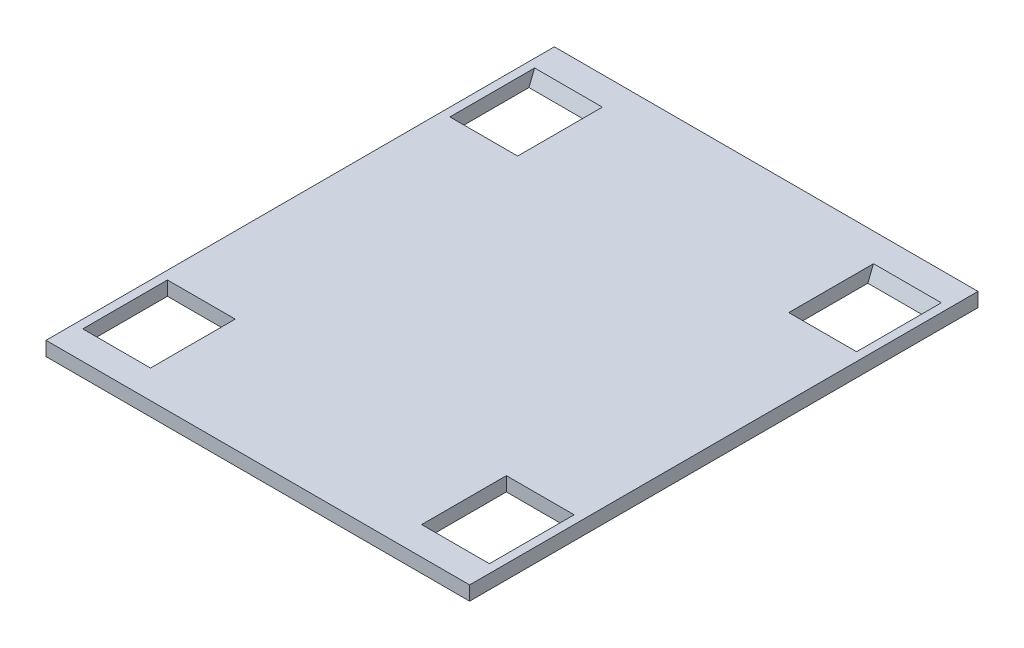
ISO-10303-21;
HEADER;
FILE_DESCRIPTION(('STEP AP214'),'2;1');
FILE_NAME('part.step','',(''),(''),'','','');
FILE_SCHEMA(('AUTOMOTIVE_DESIGN { 1 0 10303 214 1 1 1 1 }'));
ENDSEC;
DATA;
#1=APPLICATION_CONTEXT('core data for automotive mechanical design processes');
#2=APPLICATION_PROTOCOL_DEFINITION('international standard','automotive_design',2000,#1);
#3=PRODUCT_CONTEXT('',#1,'mechanical');
#4=PRODUCT('Part','Part','',(#3));
#5=PRODUCT_RELATED_PRODUCT_CATEGORY('part','',(#4));
#6=PRODUCT_DEFINITION_FORMATION('','',#4);
#7=PRODUCT_DEFINITION_CONTEXT('part definition',#1,'design');
#8=PRODUCT_DEFINITION('design','',#6,#7);
#9=PRODUCT_DEFINITION_SHAPE('','',#8);
#10=(LENGTH_UNIT() NAMED_UNIT(*) SI_UNIT(.MILLI.,.METRE.));
#11=(NAMED_UNIT(*) PLANE_ANGLE_UNIT() SI_UNIT($,.RADIAN.));
#12=(NAMED_UNIT(*) SI_UNIT($,.STERADIAN.) SOLID_ANGLE_UNIT());
#13=UNCERTAINTY_MEASURE_WITH_UNIT(LENGTH_MEASURE(1.E-05),#10,'distance_accuracy_value','');
#14=(GEOMETRIC_REPRESENTATION_CONTEXT(3) GLOBAL_UNCERTAINTY_ASSIGNED_CONTEXT((#13)) GLOBAL_UNIT_ASSIGNED_CONTEXT((#10,
#11,#12)) REPRESENTATION_CONTEXT('',''));
#15=CARTESIAN_POINT('',(0.,0.,0.));
#16=DIRECTION('',(0.,0.,1.));
#17=DIRECTION('',(1.,0.,0.));
#18=AXIS2_PLACEMENT_3D('',#15,#16,#17);
#19=CARTESIAN_POINT('',(-91.4400000000001,-0.00100000000000013,101.6));
#20=DIRECTION('',(-1.,0.,0.));
#21=DIRECTION('',(0.,0.,1.));
#22=AXIS2_PLACEMENT_3D('',#19,#20,#21);
#23=PLANE('',#22);
#24=DIRECTION('',(0.,0.928476690885259,0.371390676354104));
#25=VECTOR('',#24,1.);
#26=CARTESIAN_POINT('',(-91.4400000000002,6.35,101.6));
#27=LINE('',#26,#25);
#28=CARTESIAN_POINT('',(-91.4400000000001,0.,99.06));
#29=VERTEX_POINT('',#28);
#30=CARTESIAN_POINT('',(-91.4400000000001,6.35,101.6));
#31=VERTEX_POINT('',#30);
#32=EDGE_CURVE('E55',#29,#31,#27,.T.);
#33=ORIENTED_EDGE('',*,*,#32,.F.);
#34=DIRECTION('',(0.,0.,-1.));
#35=VECTOR('',#34,1.);
#36=CARTESIAN_POINT('',(-91.4400000000001,0.,101.6));
#37=LINE('',#36,#35);
#38=CARTESIAN_POINT('',(-91.4400000000001,0.,63.5));
#39=VERTEX_POINT('',#38);
#40=EDGE_CURVE('E240',#29,#39,#37,.T.);
#41=ORIENTED_EDGE('',*,*,#40,.T.);
#42=DIRECTION('',(0.,1.,0.));
#43=VECTOR('',#42,1.);
#44=CARTESIAN_POINT('',(-91.4400000000001,-0.00100000000000013,63.5));
#45=LINE('',#44,#43);
#46=CARTESIAN_POINT('',(-91.4400000000001,6.35,63.5));
#47=VERTEX_POINT('',#46);
#48=EDGE_CURVE('E191',#39,#47,#45,.T.);
#49=ORIENTED_EDGE('',*,*,#48,.T.);
#50=DIRECTION('',(0.,0.,1.));
#51=VECTOR('',#50,1.);
#52=CARTESIAN_POINT('',(-91.4400000000001,6.35,101.6));
#53=LINE('',#52,#51);
#54=EDGE_CURVE('E243',#47,#31,#53,.T.);
#55=ORIENTED_EDGE('',*,*,#54,.T.);
#56=EDGE_LOOP('',(#33,#41,#49,#55));
#57=FACE_BOUND('',#56,.T.);
#58=ADVANCED_FACE('F39',(#57),#23,.F.);
#59=CARTESIAN_POINT('',(-60.9600000000001,-0.00100000000000013,101.6));
#60=DIRECTION('',(1.,0.,0.));
#61=DIRECTION('',(0.,0.,-1.));
#62=AXIS2_PLACEMENT_3D('',#59,#60,#61);
#63=PLANE('',#62);
#64=DIRECTION('',(0.,0.928476690885259,0.371390676354104));
#65=VECTOR('',#64,1.);
#66=CARTESIAN_POINT('',(-60.9600000000001,6.35000000000001,101.6));
#67=LINE('',#66,#65);
#68=CARTESIAN_POINT('',(-60.9600000000001,0.,99.06));
#69=VERTEX_POINT('',#68);
#70=CARTESIAN_POINT('',(-60.9600000000001,6.35,101.6));
#71=VERTEX_POINT('',#70);
#72=EDGE_CURVE('E614',#69,#71,#67,.T.);
#73=ORIENTED_EDGE('',*,*,#72,.T.);
#74=DIRECTION('',(0.,0.,-1.));
#75=VECTOR('',#74,1.);
#76=CARTESIAN_POINT('',(-60.9600000000001,6.35,101.6));
#77=LINE('',#76,#75);
#78=CARTESIAN_POINT('',(-60.9600000000001,6.35,63.5));
#79=VERTEX_POINT('',#78);
#80=EDGE_CURVE('E250',#71,#79,#77,.T.);
#81=ORIENTED_EDGE('',*,*,#80,.T.);
#82=DIRECTION('',(0.,1.,0.));
#83=VECTOR('',#82,1.);
#84=CARTESIAN_POINT('',(-60.9600000000001,-0.00100000000000013,63.5));
#85=LINE('',#84,#83);
#86=CARTESIAN_POINT('',(-60.9600000000001,0.,63.5));
#87=VERTEX_POINT('',#86);
#88=EDGE_CURVE('E258',#87,#79,#85,.T.);
#89=ORIENTED_EDGE('',*,*,#88,.F.);
#90=DIRECTION('',(0.,0.,1.));
#91=VECTOR('',#90,1.);
#92=CARTESIAN_POINT('',(-60.9600000000001,0.,101.6));
#93=LINE('',#92,#91);
#94=EDGE_CURVE('E63',#87,#69,#93,.T.);
#95=ORIENTED_EDGE('',*,*,#94,.T.);
#96=EDGE_LOOP('',(#73,#81,#89,#95));
#97=FACE_BOUND('',#96,.T.);
#98=ADVANCED_FACE('F408',(#97),#63,.F.);
#99=CARTESIAN_POINT('',(91.4400000000001,-0.00100000000000013,-101.6));
#100=DIRECTION('',(1.,0.,0.));
#101=DIRECTION('',(0.,0.,-1.));
#102=AXIS2_PLACEMENT_3D('',#99,#100,#101);
#103=PLANE('',#102);
#104=DIRECTION('',(0.,0.928476690885259,-0.371390676354104));
#105=VECTOR('',#104,1.);
#106=CARTESIAN_POINT('',(91.4400000000002,6.35,-101.6));
#107=LINE('',#106,#105);
#108=CARTESIAN_POINT('',(91.4400000000001,0.,-99.06));
#109=VERTEX_POINT('',#108);
#110=CARTESIAN_POINT('',(91.4400000000001,6.35,-101.6));
#111=VERTEX_POINT('',#110);
#112=EDGE_CURVE('E222',#109,#111,#107,.T.);
#113=ORIENTED_EDGE('',*,*,#112,.F.);
#114=DIRECTION('',(0.,0.,1.));
#115=VECTOR('',#114,1.);
#116=CARTESIAN_POINT('',(91.4400000000001,0.,-101.6));
#117=LINE('',#116,#115);
#118=CARTESIAN_POINT('',(91.4400000000001,0.,-63.5));
#119=VERTEX_POINT('',#118);
#120=EDGE_CURVE('E299',#109,#119,#117,.T.);
#121=ORIENTED_EDGE('',*,*,#120,.T.);
#122=DIRECTION('',(0.,1.,0.));
#123=VECTOR('',#122,1.);
#124=CARTESIAN_POINT('',(91.4400000000001,-0.00100000000000013,-63.5));
#125=LINE('',#124,#123);
#126=CARTESIAN_POINT('',(91.4400000000001,6.35,-63.5));
#127=VERTEX_POINT('',#126);
#128=EDGE_CURVE('E267',#119,#127,#125,.T.);
#129=ORIENTED_EDGE('',*,*,#128,.T.);
#130=DIRECTION('',(0.,0.,-1.));
#131=VECTOR('',#130,1.);
#132=CARTESIAN_POINT('',(91.4400000000001,6.35,-101.6));
#133=LINE('',#132,#131);
#134=EDGE_CURVE('E302',#127,#111,#133,.T.);
#135=ORIENTED_EDGE('',*,*,#134,.T.);
#136=EDGE_LOOP('',(#113,#121,#129,#135));
#137=FACE_BOUND('',#136,.T.);
#138=ADVANCED_FACE('F413',(#137),#103,.F.);
#139=CARTESIAN_POINT('',(60.9600000000001,-0.00100000000000013,-101.6));
#140=DIRECTION('',(-1.,0.,0.));
#141=DIRECTION('',(0.,0.,1.));
#142=AXIS2_PLACEMENT_3D('',#139,#140,#141);
#143=PLANE('',#142);
#144=DIRECTION('',(0.,0.928476690885259,-0.371390676354104));
#145=VECTOR('',#144,1.);
#146=CARTESIAN_POINT('',(60.9600000000001,6.35000000000001,-101.6));
#147=LINE('',#146,#145);
#148=CARTESIAN_POINT('',(60.9600000000001,0.,-99.06));
#149=VERTEX_POINT('',#148);
#150=CARTESIAN_POINT('',(60.9600000000001,6.35,-101.6));
#151=VERTEX_POINT('',#150);
#152=EDGE_CURVE('E218',#149,#151,#147,.T.);
#153=ORIENTED_EDGE('',*,*,#152,.T.);
#154=DIRECTION('',(0.,0.,1.));
#155=VECTOR('',#154,1.);
#156=CARTESIAN_POINT('',(60.9600000000001,6.35,-101.6));
#157=LINE('',#156,#155);
#158=CARTESIAN_POINT('',(60.9600000000001,6.35,-63.5));
#159=VERTEX_POINT('',#158);
#160=EDGE_CURVE('E309',#151,#159,#157,.T.);
#161=ORIENTED_EDGE('',*,*,#160,.T.);
#162=DIRECTION('',(0.,1.,0.));
#163=VECTOR('',#162,1.);
#164=CARTESIAN_POINT('',(60.9600000000001,-0.00100000000000013,-63.5));
#165=LINE('',#164,#163);
#166=CARTESIAN_POINT('',(60.9600000000001,0.,-63.5));
#167=VERTEX_POINT('',#166);
#168=EDGE_CURVE('E317',#167,#159,#165,.T.);
#169=ORIENTED_EDGE('',*,*,#168,.F.);
#170=DIRECTION('',(0.,0.,-1.));
#171=VECTOR('',#170,1.);
#172=CARTESIAN_POINT('',(60.9600000000001,0.,-101.6));
#173=LINE('',#172,#171);
#174=EDGE_CURVE('E226',#167,#149,#173,.T.);
#175=ORIENTED_EDGE('',*,*,#174,.T.);
#176=EDGE_LOOP('',(#153,#161,#169,#175));
#177=FACE_BOUND('',#176,.T.);
#178=ADVANCED_FACE('F406',(#177),#143,.F.);
#179=CARTESIAN_POINT('',(95.25,6.35,-114.3));
#180=DIRECTION('',(-1.,0.,0.));
#181=DIRECTION('',(0.,0.,1.));
#182=AXIS2_PLACEMENT_3D('',#179,#180,#181);
#183=PLANE('',#182);
#184=DIRECTION('',(0.,0.,-1.));
#185=VECTOR('',#184,1.);
#186=CARTESIAN_POINT('',(95.25,0.,-114.3));
#187=LINE('',#186,#185);
#188=CARTESIAN_POINT('',(95.25,0.,114.3));
#189=VERTEX_POINT('',#188);
#190=CARTESIAN_POINT('',(95.25,0.,-114.3));
#191=VERTEX_POINT('',#190);
#192=EDGE_CURVE('E345',#189,#191,#187,.T.);
#193=ORIENTED_EDGE('',*,*,#192,.T.);
#194=DIRECTION('',(0.,-1.,0.));
#195=VECTOR('',#194,1.);
#196=CARTESIAN_POINT('',(95.25,6.35,-114.3));
#197=LINE('',#196,#195);
#198=CARTESIAN_POINT('',(95.25,6.35,-114.3));
#199=VERTEX_POINT('',#198);
#200=EDGE_CURVE('E11',#199,#191,#197,.T.);
#201=ORIENTED_EDGE('',*,*,#200,.F.);
#202=DIRECTION('',(0.,0.,-1.));
#203=VECTOR('',#202,1.);
#204=CARTESIAN_POINT('',(95.25,6.35,-114.3));
#205=LINE('',#204,#203);
#206=CARTESIAN_POINT('',(95.25,6.35,114.3));
#207=VERTEX_POINT('',#206);
#208=EDGE_CURVE('E346',#207,#199,#205,.T.);
#209=ORIENTED_EDGE('',*,*,#208,.F.);
#210=DIRECTION('',(0.,-1.,0.));
#211=VECTOR('',#210,1.);
#212=CARTESIAN_POINT('',(95.25,6.35,114.3));
#213=LINE('',#212,#211);
#214=EDGE_CURVE('E360',#207,#189,#213,.T.);
#215=ORIENTED_EDGE('',*,*,#214,.T.);
#216=EDGE_LOOP('',(#193,#201,#209,#215));
#217=FACE_BOUND('',#216,.T.);
#218=ADVANCED_FACE('F41',(#217),#183,.F.);
#219=CARTESIAN_POINT('',(-95.25,6.35,-114.3));
#220=DIRECTION('',(0.,0.,1.));
#221=DIRECTION('',(1.,0.,0.));
#222=AXIS2_PLACEMENT_3D('',#219,#220,#221);
#223=PLANE('',#222);
#224=DIRECTION('',(-1.,0.,0.));
#225=VECTOR('',#224,1.);
#226=CARTESIAN_POINT('',(-95.25,0.,-114.3));
#227=LINE('',#226,#225);
#228=CARTESIAN_POINT('',(-95.25,0.,-114.3));
#229=VERTEX_POINT('',#228);
#230=EDGE_CURVE('E364',#191,#229,#227,.T.);
#231=ORIENTED_EDGE('',*,*,#230,.T.);
#232=DIRECTION('',(0.,-1.,0.));
#233=VECTOR('',#232,1.);
#234=CARTESIAN_POINT('',(-95.25,6.35,-114.3));
#235=LINE('',#234,#233);
#236=CARTESIAN_POINT('',(-95.25,6.35,-114.3));
#237=VERTEX_POINT('',#236);
#238=EDGE_CURVE('E48',#237,#229,#235,.T.);
#239=ORIENTED_EDGE('',*,*,#238,.F.);
#240=DIRECTION('',(-1.,0.,0.));
#241=VECTOR('',#240,1.);
#242=CARTESIAN_POINT('',(-95.25,6.35,-114.3));
#243=LINE('',#242,#241);
#244=EDGE_CURVE('E350',#199,#237,#243,.T.);
#245=ORIENTED_EDGE('',*,*,#244,.F.);
#246=ORIENTED_EDGE('',*,*,#200,.T.);
#247=EDGE_LOOP('',(#231,#239,#245,#246));
#248=FACE_BOUND('',#247,.T.);
#249=ADVANCED_FACE('F399',(#248),#223,.F.);
#250=CARTESIAN_POINT('',(-95.25,6.35,-114.3));
#251=DIRECTION('',(1.,0.,0.));
#252=DIRECTION('',(0.,0.,-1.));
#253=AXIS2_PLACEMENT_3D('',#250,#251,#252);
#254=PLANE('',#253);
#255=DIRECTION('',(0.,0.,1.));
#256=VECTOR('',#255,1.);
#257=CARTESIAN_POINT('',(-95.25,0.,-114.3));
#258=LINE('',#257,#256);
#259=CARTESIAN_POINT('',(-95.25,0.,114.3));
#260=VERTEX_POINT('',#259);
#261=EDGE_CURVE('E367',#229,#260,#258,.T.);
#262=ORIENTED_EDGE('',*,*,#261,.T.);
#263=DIRECTION('',(0.,-1.,0.));
#264=VECTOR('',#263,1.);
#265=CARTESIAN_POINT('',(-95.25,6.35,114.3));
#266=LINE('',#265,#264);
#267=CARTESIAN_POINT('',(-95.25,6.35,114.3));
#268=VERTEX_POINT('',#267);
#269=EDGE_CURVE('E375',#268,#260,#266,.T.);
#270=ORIENTED_EDGE('',*,*,#269,.F.);
#271=DIRECTION('',(0.,0.,1.));
#272=VECTOR('',#271,1.);
#273=CARTESIAN_POINT('',(-95.25,6.35,-114.3));
#274=LINE('',#273,#272);
#275=EDGE_CURVE('E354',#237,#268,#274,.T.);
#276=ORIENTED_EDGE('',*,*,#275,.F.);
#277=ORIENTED_EDGE('',*,*,#238,.T.);
#278=EDGE_LOOP('',(#262,#270,#276,#277));
#279=FACE_BOUND('',#278,.T.);
#280=ADVANCED_FACE('F384',(#279),#254,.F.);
#281=CARTESIAN_POINT('',(-95.25,6.35,114.3));
#282=DIRECTION('',(0.,0.,-1.));
#283=DIRECTION('',(-1.,0.,0.));
#284=AXIS2_PLACEMENT_3D('',#281,#282,#283);
#285=PLANE('',#284);
#286=DIRECTION('',(1.,0.,0.));
#287=VECTOR('',#286,1.);
#288=CARTESIAN_POINT('',(-95.25,0.,114.3));
#289=LINE('',#288,#287);
#290=EDGE_CURVE('E351',#260,#189,#289,.T.);
#291=ORIENTED_EDGE('',*,*,#290,.T.);
#292=ORIENTED_EDGE('',*,*,#214,.F.);
#293=DIRECTION('',(1.,0.,0.));
#294=VECTOR('',#293,1.);
#295=CARTESIAN_POINT('',(-95.25,6.35,114.3));
#296=LINE('',#295,#294);
#297=EDGE_CURVE('E357',#268,#207,#296,.T.);
#298=ORIENTED_EDGE('',*,*,#297,.F.);
#299=ORIENTED_EDGE('',*,*,#269,.T.);
#300=EDGE_LOOP('',(#291,#292,#298,#299));
#301=FACE_BOUND('',#300,.T.);
#302=ADVANCED_FACE('F392',(#301),#285,.F.);
#303=CARTESIAN_POINT('',(0.,6.35,0.));
#304=DIRECTION('',(0.,1.,0.));
#305=DIRECTION('',(0.,0.,1.));
#306=AXIS2_PLACEMENT_3D('',#303,#304,#305);
#307=PLANE('',#306);
#308=ORIENTED_EDGE('',*,*,#134,.F.);
#309=DIRECTION('',(1.,0.,0.));
#310=VECTOR('',#309,1.);
#311=CARTESIAN_POINT('',(91.4400000000001,6.35,-63.5));
#312=LINE('',#311,#310);
#313=EDGE_CURVE('E313',#159,#127,#312,.T.);
#314=ORIENTED_EDGE('',*,*,#313,.F.);
#315=ORIENTED_EDGE('',*,*,#160,.F.);
#316=DIRECTION('',(-1.,0.,0.));
#317=VECTOR('',#316,1.);
#318=CARTESIAN_POINT('',(91.4400000000001,6.35,-101.6));
#319=LINE('',#318,#317);
#320=EDGE_CURVE('E305',#111,#151,#319,.T.);
#321=ORIENTED_EDGE('',*,*,#320,.F.);
#322=EDGE_LOOP('',(#308,#314,#315,#321));
#323=FACE_BOUND('',#322,.T.);
#324=DIRECTION('',(1.,0.,0.));
#325=VECTOR('',#324,1.);
#326=CARTESIAN_POINT('',(91.4400000000001,6.35,101.6));
#327=LINE('',#326,#325);
#328=CARTESIAN_POINT('',(60.9600000000001,6.35,101.6));
#329=VERTEX_POINT('',#328);
#330=CARTESIAN_POINT('',(91.4400000000001,6.35,101.6));
#331=VERTEX_POINT('',#330);
#332=EDGE_CURVE('E270',#329,#331,#327,.T.);
#333=ORIENTED_EDGE('',*,*,#332,.F.);
#334=DIRECTION('',(0.,0.,1.));
#335=VECTOR('',#334,1.);
#336=CARTESIAN_POINT('',(60.9600000000001,6.35,101.6));
#337=LINE('',#336,#335);
#338=CARTESIAN_POINT('',(60.9600000000001,6.35,63.5));
#339=VERTEX_POINT('',#338);
#340=EDGE_CURVE('E282',#339,#329,#337,.T.);
#341=ORIENTED_EDGE('',*,*,#340,.F.);
#342=DIRECTION('',(-1.,0.,0.));
#343=VECTOR('',#342,1.);
#344=CARTESIAN_POINT('',(91.4400000000001,6.35,63.5));
#345=LINE('',#344,#343);
#346=CARTESIAN_POINT('',(91.4400000000001,6.35,63.5));
#347=VERTEX_POINT('',#346);
#348=EDGE_CURVE('E278',#347,#339,#345,.T.);
#349=ORIENTED_EDGE('',*,*,#348,.F.);
#350=DIRECTION('',(0.,0.,-1.));
#351=VECTOR('',#350,1.);
#352=CARTESIAN_POINT('',(91.4400000000001,6.35,101.6));
#353=LINE('',#352,#351);
#354=EDGE_CURVE('E274',#331,#347,#353,.T.);
#355=ORIENTED_EDGE('',*,*,#354,.F.);
#356=EDGE_LOOP('',(#333,#341,#349,#355));
#357=FACE_BOUND('',#356,.T.);
#358=ORIENTED_EDGE('',*,*,#54,.F.);
#359=DIRECTION('',(-1.,0.,0.));
#360=VECTOR('',#359,1.);
#361=CARTESIAN_POINT('',(-91.4400000000001,6.35,63.5));
#362=LINE('',#361,#360);
#363=EDGE_CURVE('E254',#79,#47,#362,.T.);
#364=ORIENTED_EDGE('',*,*,#363,.F.);
#365=ORIENTED_EDGE('',*,*,#80,.F.);
#366=DIRECTION('',(1.,0.,0.));
#367=VECTOR('',#366,1.);
#368=CARTESIAN_POINT('',(-91.4400000000001,6.35,101.6));
#369=LINE('',#368,#367);
#370=EDGE_CURVE('E246',#31,#71,#369,.T.);
#371=ORIENTED_EDGE('',*,*,#370,.F.);
#372=EDGE_LOOP('',(#358,#364,#365,#371));
#373=FACE_BOUND('',#372,.T.);
#374=DIRECTION('',(0.,0.,1.));
#375=VECTOR('',#374,1.);
#376=CARTESIAN_POINT('',(-91.4400000000001,6.35,-101.6));
#377=LINE('',#376,#375);
#378=CARTESIAN_POINT('',(-91.4400000000001,6.35,-101.6));
#379=VERTEX_POINT('',#378);
#380=CARTESIAN_POINT('',(-91.4400000000001,6.35,-63.5));
#381=VERTEX_POINT('',#380);
#382=EDGE_CURVE('E324',#379,#381,#377,.T.);
#383=ORIENTED_EDGE('',*,*,#382,.F.);
#384=DIRECTION('',(-1.,0.,0.));
#385=VECTOR('',#384,1.);
#386=CARTESIAN_POINT('',(-91.4400000000001,6.35,-101.6));
#387=LINE('',#386,#385);
#388=CARTESIAN_POINT('',(-60.9600000000001,6.35,-101.6));
#389=VERTEX_POINT('',#388);
#390=EDGE_CURVE('E333',#389,#379,#387,.T.);
#391=ORIENTED_EDGE('',*,*,#390,.F.);
#392=DIRECTION('',(0.,0.,-1.));
#393=VECTOR('',#392,1.);
#394=CARTESIAN_POINT('',(-60.9600000000001,6.35,-101.6));
#395=LINE('',#394,#393);
#396=CARTESIAN_POINT('',(-60.9600000000001,6.35,-63.5));
#397=VERTEX_POINT('',#396);
#398=EDGE_CURVE('E197',#397,#389,#395,.T.);
#399=ORIENTED_EDGE('',*,*,#398,.F.);
#400=DIRECTION('',(1.,0.,0.));
#401=VECTOR('',#400,1.);
#402=CARTESIAN_POINT('',(-91.4400000000001,6.35,-63.5));
#403=LINE('',#402,#401);
#404=EDGE_CURVE('E327',#381,#397,#403,.T.);
#405=ORIENTED_EDGE('',*,*,#404,.F.);
#406=EDGE_LOOP('',(#383,#391,#399,#405));
#407=FACE_BOUND('',#406,.T.);
#408=ORIENTED_EDGE('',*,*,#208,.T.);
#409=ORIENTED_EDGE('',*,*,#244,.T.);
#410=ORIENTED_EDGE('',*,*,#275,.T.);
#411=ORIENTED_EDGE('',*,*,#297,.T.);
#412=EDGE_LOOP('',(#408,#409,#410,#411));
#413=FACE_BOUND('',#412,.T.);
#414=ADVANCED_FACE('F398',(#323,#357,#373,#407,#413),#307,.T.);
#415=CARTESIAN_POINT('',(0.,0.,0.));
#416=DIRECTION('',(0.,1.,0.));
#417=DIRECTION('',(0.,0.,1.));
#418=AXIS2_PLACEMENT_3D('',#415,#416,#417);
#419=PLANE('',#418);
#420=ORIENTED_EDGE('',*,*,#40,.F.);
#421=DIRECTION('',(-1.,0.,0.));
#422=VECTOR('',#421,1.);
#423=CARTESIAN_POINT('',(95.2519999999999,0.,99.0600000000001));
#424=LINE('',#423,#422);
#425=EDGE_CURVE('E616',#69,#29,#424,.T.);
#426=ORIENTED_EDGE('',*,*,#425,.F.);
#427=ORIENTED_EDGE('',*,*,#94,.F.);
#428=DIRECTION('',(1.,0.,0.));
#429=VECTOR('',#428,1.);
#430=CARTESIAN_POINT('',(-91.4400000000001,0.,63.5));
#431=LINE('',#430,#429);
#432=EDGE_CURVE('E235',#39,#87,#431,.T.);
#433=ORIENTED_EDGE('',*,*,#432,.F.);
#434=EDGE_LOOP('',(#420,#426,#427,#433));
#435=FACE_BOUND('',#434,.T.);
#436=DIRECTION('',(-1.,0.,0.));
#437=VECTOR('',#436,1.);
#438=CARTESIAN_POINT('',(95.252,0.,-99.0600000000001));
#439=LINE('',#438,#437);
#440=CARTESIAN_POINT('',(-60.96,0.,-99.06));
#441=VERTEX_POINT('',#440);
#442=CARTESIAN_POINT('',(-91.4400000000001,0.,-99.06));
#443=VERTEX_POINT('',#442);
#444=EDGE_CURVE('E183',#441,#443,#439,.T.);
#445=ORIENTED_EDGE('',*,*,#444,.T.);
#446=DIRECTION('',(0.,0.,-1.));
#447=VECTOR('',#446,1.);
#448=CARTESIAN_POINT('',(-91.4400000000001,0.,-101.6));
#449=LINE('',#448,#447);
#450=CARTESIAN_POINT('',(-91.4400000000001,0.,-63.5));
#451=VERTEX_POINT('',#450);
#452=EDGE_CURVE('E190',#451,#443,#449,.T.);
#453=ORIENTED_EDGE('',*,*,#452,.F.);
#454=DIRECTION('',(-1.,0.,0.));
#455=VECTOR('',#454,1.);
#456=CARTESIAN_POINT('',(-91.4400000000001,0.,-63.5));
#457=LINE('',#456,#455);
#458=CARTESIAN_POINT('',(-60.9600000000001,0.,-63.5));
#459=VERTEX_POINT('',#458);
#460=EDGE_CURVE('E186',#459,#451,#457,.T.);
#461=ORIENTED_EDGE('',*,*,#460,.F.);
#462=DIRECTION('',(0.,0.,1.));
#463=VECTOR('',#462,1.);
#464=CARTESIAN_POINT('',(-60.9600000000001,0.,-101.6));
#465=LINE('',#464,#463);
#466=EDGE_CURVE('E177',#441,#459,#465,.T.);
#467=ORIENTED_EDGE('',*,*,#466,.F.);
#468=EDGE_LOOP('',(#445,#453,#461,#467));
#469=FACE_BOUND('',#468,.T.);
#470=DIRECTION('',(0.,0.,-1.));
#471=VECTOR('',#470,1.);
#472=CARTESIAN_POINT('',(60.9600000000001,0.,101.6));
#473=LINE('',#472,#471);
#474=CARTESIAN_POINT('',(60.9600000000001,0.,99.06));
#475=VERTEX_POINT('',#474);
#476=CARTESIAN_POINT('',(60.9600000000001,0.,63.5));
#477=VERTEX_POINT('',#476);
#478=EDGE_CURVE('E266',#475,#477,#473,.T.);
#479=ORIENTED_EDGE('',*,*,#478,.F.);
#480=DIRECTION('',(1.,0.,0.));
#481=VECTOR('',#480,1.);
#482=CARTESIAN_POINT('',(-95.252,0.,99.0600000000001));
#483=LINE('',#482,#481);
#484=CARTESIAN_POINT('',(91.4400000000001,0.,99.06));
#485=VERTEX_POINT('',#484);
#486=EDGE_CURVE('E214',#475,#485,#483,.T.);
#487=ORIENTED_EDGE('',*,*,#486,.T.);
#488=DIRECTION('',(0.,0.,1.));
#489=VECTOR('',#488,1.);
#490=CARTESIAN_POINT('',(91.4400000000001,0.,101.6));
#491=LINE('',#490,#489);
#492=CARTESIAN_POINT('',(91.4400000000001,0.,63.5));
#493=VERTEX_POINT('',#492);
#494=EDGE_CURVE('E236',#493,#485,#491,.T.);
#495=ORIENTED_EDGE('',*,*,#494,.F.);
#496=DIRECTION('',(1.,0.,0.));
#497=VECTOR('',#496,1.);
#498=CARTESIAN_POINT('',(91.4400000000001,0.,63.5));
#499=LINE('',#498,#497);
#500=EDGE_CURVE('E263',#477,#493,#499,.T.);
#501=ORIENTED_EDGE('',*,*,#500,.F.);
#502=EDGE_LOOP('',(#479,#487,#495,#501));
#503=FACE_BOUND('',#502,.T.);
#504=ORIENTED_EDGE('',*,*,#120,.F.);
#505=DIRECTION('',(1.,0.,0.));
#506=VECTOR('',#505,1.);
#507=CARTESIAN_POINT('',(-95.2519999999999,0.,-99.0600000000001));
#508=LINE('',#507,#506);
#509=EDGE_CURVE('E227',#149,#109,#508,.T.);
#510=ORIENTED_EDGE('',*,*,#509,.F.);
#511=ORIENTED_EDGE('',*,*,#174,.F.);
#512=DIRECTION('',(-1.,0.,0.));
#513=VECTOR('',#512,1.);
#514=CARTESIAN_POINT('',(91.4400000000001,0.,-63.5));
#515=LINE('',#514,#513);
#516=EDGE_CURVE('E295',#119,#167,#515,.T.);
#517=ORIENTED_EDGE('',*,*,#516,.F.);
#518=EDGE_LOOP('',(#504,#510,#511,#517));
#519=FACE_BOUND('',#518,.T.);
#520=ORIENTED_EDGE('',*,*,#192,.F.);
#521=ORIENTED_EDGE('',*,*,#290,.F.);
#522=ORIENTED_EDGE('',*,*,#261,.F.);
#523=ORIENTED_EDGE('',*,*,#230,.F.);
#524=EDGE_LOOP('',(#520,#521,#522,#523));
#525=FACE_BOUND('',#524,.T.);
#526=ADVANCED_FACE('F179',(#435,#469,#503,#519,#525),#419,.F.);
#527=CARTESIAN_POINT('',(-91.4400000000001,-0.00100000000000013,-101.6));
#528=DIRECTION('',(-1.,0.,0.));
#529=DIRECTION('',(0.,0.,1.));
#530=AXIS2_PLACEMENT_3D('',#527,#528,#529);
#531=PLANE('',#530);
#532=ORIENTED_EDGE('',*,*,#452,.T.);
#533=DIRECTION('',(0.,0.928476690885259,-0.371390676354104));
#534=VECTOR('',#533,1.);
#535=CARTESIAN_POINT('',(-91.4400000000002,6.35,-101.6));
#536=LINE('',#535,#534);
#537=EDGE_CURVE('E204',#443,#379,#536,.T.);
#538=ORIENTED_EDGE('',*,*,#537,.T.);
#539=ORIENTED_EDGE('',*,*,#382,.T.);
#540=DIRECTION('',(0.,1.,0.));
#541=VECTOR('',#540,1.);
#542=CARTESIAN_POINT('',(-91.4400000000001,-0.00100000000000013,-63.5));
#543=LINE('',#542,#541);
#544=EDGE_CURVE('E336',#451,#381,#543,.T.);
#545=ORIENTED_EDGE('',*,*,#544,.F.);
#546=EDGE_LOOP('',(#532,#538,#539,#545));
#547=FACE_BOUND('',#546,.T.);
#548=ADVANCED_FACE('F444',(#547),#531,.F.);
#549=CARTESIAN_POINT('',(-60.9600000000001,-0.00100000000000013,-101.6));
#550=DIRECTION('',(1.,0.,0.));
#551=DIRECTION('',(0.,0.,-1.));
#552=AXIS2_PLACEMENT_3D('',#549,#550,#551);
#553=PLANE('',#552);
#554=ORIENTED_EDGE('',*,*,#398,.T.);
#555=DIRECTION('',(0.,0.928476690885259,-0.371390676354104));
#556=VECTOR('',#555,1.);
#557=CARTESIAN_POINT('',(-60.9600000000001,6.35000000000001,-101.6));
#558=LINE('',#557,#556);
#559=EDGE_CURVE('E194',#441,#389,#558,.T.);
#560=ORIENTED_EDGE('',*,*,#559,.F.);
#561=ORIENTED_EDGE('',*,*,#466,.T.);
#562=DIRECTION('',(0.,1.,0.));
#563=VECTOR('',#562,1.);
#564=CARTESIAN_POINT('',(-60.9600000000001,-0.00100000000000013,-63.5));
#565=LINE('',#564,#563);
#566=EDGE_CURVE('E337',#459,#397,#565,.T.);
#567=ORIENTED_EDGE('',*,*,#566,.T.);
#568=EDGE_LOOP('',(#554,#560,#561,#567));
#569=FACE_BOUND('',#568,.T.);
#570=ADVANCED_FACE('F195',(#569),#553,.F.);
#571=CARTESIAN_POINT('',(-91.4400000000001,-0.00100000000000013,-63.5));
#572=DIRECTION('',(0.,0.,1.));
#573=DIRECTION('',(1.,0.,0.));
#574=AXIS2_PLACEMENT_3D('',#571,#572,#573);
#575=PLANE('',#574);
#576=ORIENTED_EDGE('',*,*,#460,.T.);
#577=ORIENTED_EDGE('',*,*,#544,.T.);
#578=ORIENTED_EDGE('',*,*,#404,.T.);
#579=ORIENTED_EDGE('',*,*,#566,.F.);
#580=EDGE_LOOP('',(#576,#577,#578,#579));
#581=FACE_BOUND('',#580,.T.);
#582=ADVANCED_FACE('F443',(#581),#575,.F.);
#583=CARTESIAN_POINT('',(-91.4400000000001,-0.00100000000000013,63.5));
#584=DIRECTION('',(0.,0.,-1.));
#585=DIRECTION('',(-1.,0.,0.));
#586=AXIS2_PLACEMENT_3D('',#583,#584,#585);
#587=PLANE('',#586);
#588=ORIENTED_EDGE('',*,*,#432,.T.);
#589=ORIENTED_EDGE('',*,*,#88,.T.);
#590=ORIENTED_EDGE('',*,*,#363,.T.);
#591=ORIENTED_EDGE('',*,*,#48,.F.);
#592=EDGE_LOOP('',(#588,#589,#590,#591));
#593=FACE_BOUND('',#592,.T.);
#594=ADVANCED_FACE('F421',(#593),#587,.F.);
#595=CARTESIAN_POINT('',(60.9600000000001,-0.00100000000000013,101.6));
#596=DIRECTION('',(-1.,0.,0.));
#597=DIRECTION('',(0.,0.,1.));
#598=AXIS2_PLACEMENT_3D('',#595,#596,#597);
#599=PLANE('',#598);
#600=ORIENTED_EDGE('',*,*,#340,.T.);
#601=DIRECTION('',(0.,0.928476690885259,0.371390676354104));
#602=VECTOR('',#601,1.);
#603=CARTESIAN_POINT('',(60.9600000000001,6.35000000000001,101.6));
#604=LINE('',#603,#602);
#605=EDGE_CURVE('E208',#475,#329,#604,.T.);
#606=ORIENTED_EDGE('',*,*,#605,.F.);
#607=ORIENTED_EDGE('',*,*,#478,.T.);
#608=DIRECTION('',(0.,1.,0.));
#609=VECTOR('',#608,1.);
#610=CARTESIAN_POINT('',(60.9600000000001,-0.00100000000000013,63.5));
#611=LINE('',#610,#609);
#612=EDGE_CURVE('E286',#477,#339,#611,.T.);
#613=ORIENTED_EDGE('',*,*,#612,.T.);
#614=EDGE_LOOP('',(#600,#606,#607,#613));
#615=FACE_BOUND('',#614,.T.);
#616=ADVANCED_FACE('F417',(#615),#599,.F.);
#617=CARTESIAN_POINT('',(91.4400000000001,-0.00100000000000013,63.5));
#618=DIRECTION('',(0.,0.,-1.));
#619=DIRECTION('',(-1.,0.,0.));
#620=AXIS2_PLACEMENT_3D('',#617,#618,#619);
#621=PLANE('',#620);
#622=ORIENTED_EDGE('',*,*,#500,.T.);
#623=DIRECTION('',(0.,1.,0.));
#624=VECTOR('',#623,1.);
#625=CARTESIAN_POINT('',(91.4400000000001,-0.00100000000000013,63.5));
#626=LINE('',#625,#624);
#627=EDGE_CURVE('E285',#493,#347,#626,.T.);
#628=ORIENTED_EDGE('',*,*,#627,.T.);
#629=ORIENTED_EDGE('',*,*,#348,.T.);
#630=ORIENTED_EDGE('',*,*,#612,.F.);
#631=EDGE_LOOP('',(#622,#628,#629,#630));
#632=FACE_BOUND('',#631,.T.);
#633=ADVANCED_FACE('F420',(#632),#621,.F.);
#634=CARTESIAN_POINT('',(91.4400000000001,-0.00100000000000013,101.6));
#635=DIRECTION('',(1.,0.,0.));
#636=DIRECTION('',(0.,0.,-1.));
#637=AXIS2_PLACEMENT_3D('',#634,#635,#636);
#638=PLANE('',#637);
#639=ORIENTED_EDGE('',*,*,#494,.T.);
#640=DIRECTION('',(0.,0.928476690885259,0.371390676354104));
#641=VECTOR('',#640,1.);
#642=CARTESIAN_POINT('',(91.4400000000002,6.35,101.6));
#643=LINE('',#642,#641);
#644=EDGE_CURVE('E215',#485,#331,#643,.T.);
#645=ORIENTED_EDGE('',*,*,#644,.T.);
#646=ORIENTED_EDGE('',*,*,#354,.T.);
#647=ORIENTED_EDGE('',*,*,#627,.F.);
#648=EDGE_LOOP('',(#639,#645,#646,#647));
#649=FACE_BOUND('',#648,.T.);
#650=ADVANCED_FACE('F425',(#649),#638,.F.);
#651=CARTESIAN_POINT('',(91.4400000000001,-0.00100000000000013,-63.5));
#652=DIRECTION('',(0.,0.,1.));
#653=DIRECTION('',(1.,0.,0.));
#654=AXIS2_PLACEMENT_3D('',#651,#652,#653);
#655=PLANE('',#654);
#656=ORIENTED_EDGE('',*,*,#516,.T.);
#657=ORIENTED_EDGE('',*,*,#168,.T.);
#658=ORIENTED_EDGE('',*,*,#313,.T.);
#659=ORIENTED_EDGE('',*,*,#128,.F.);
#660=EDGE_LOOP('',(#656,#657,#658,#659));
#661=FACE_BOUND('',#660,.T.);
#662=ADVANCED_FACE('F429',(#661),#655,.F.);
#663=CARTESIAN_POINT('',(-95.2519999999999,6.35,-101.6));
#664=DIRECTION('',(0.,-0.371390676354104,-0.928476690885259));
#665=DIRECTION('',(0.,0.928476690885259,-0.371390676354104));
#666=AXIS2_PLACEMENT_3D('',#663,#664,#665);
#667=PLANE('',#666);
#668=ORIENTED_EDGE('',*,*,#152,.F.);
#669=ORIENTED_EDGE('',*,*,#509,.T.);
#670=ORIENTED_EDGE('',*,*,#112,.T.);
#671=ORIENTED_EDGE('',*,*,#320,.T.);
#672=EDGE_LOOP('',(#668,#669,#670,#671));
#673=FACE_BOUND('',#672,.T.);
#674=ADVANCED_FACE('F433',(#673),#667,.F.);
#675=CARTESIAN_POINT('',(-95.252,6.35,101.6));
#676=DIRECTION('',(0.,0.371390676354104,-0.928476690885259));
#677=DIRECTION('',(0.,0.928476690885259,0.371390676354104));
#678=AXIS2_PLACEMENT_3D('',#675,#676,#677);
#679=PLANE('',#678);
#680=ORIENTED_EDGE('',*,*,#486,.F.);
#681=ORIENTED_EDGE('',*,*,#605,.T.);
#682=ORIENTED_EDGE('',*,*,#332,.T.);
#683=ORIENTED_EDGE('',*,*,#644,.F.);
#684=EDGE_LOOP('',(#680,#681,#682,#683));
#685=FACE_BOUND('',#684,.T.);
#686=ADVANCED_FACE('F514',(#685),#679,.T.);
#687=CARTESIAN_POINT('',(95.252,6.35,-101.6));
#688=DIRECTION('',(0.,0.371390676354104,0.928476690885259));
#689=DIRECTION('',(0.,-0.928476690885259,0.371390676354104));
#690=AXIS2_PLACEMENT_3D('',#687,#688,#689);
#691=PLANE('',#690);
#692=ORIENTED_EDGE('',*,*,#444,.F.);
#693=ORIENTED_EDGE('',*,*,#559,.T.);
#694=ORIENTED_EDGE('',*,*,#390,.T.);
#695=ORIENTED_EDGE('',*,*,#537,.F.);
#696=EDGE_LOOP('',(#692,#693,#694,#695));
#697=FACE_BOUND('',#696,.T.);
#698=ADVANCED_FACE('F203',(#697),#691,.T.);
#699=CARTESIAN_POINT('',(95.2519999999999,6.35,101.6));
#700=DIRECTION('',(0.,-0.371390676354104,0.928476690885259));
#701=DIRECTION('',(0.,-0.928476690885259,-0.371390676354104));
#702=AXIS2_PLACEMENT_3D('',#699,#700,#701);
#703=PLANE('',#702);
#704=ORIENTED_EDGE('',*,*,#72,.F.);
#705=ORIENTED_EDGE('',*,*,#425,.T.);
#706=ORIENTED_EDGE('',*,*,#32,.T.);
#707=ORIENTED_EDGE('',*,*,#370,.T.);
#708=EDGE_LOOP('',(#704,#705,#706,#707));
#709=FACE_BOUND('',#708,.T.);
#710=ADVANCED_FACE('F528',(#709),#703,.F.);
#711=CLOSED_SHELL('',(#58,#98,#138,#178,#218,#249,#280,#302,#414,#526,#548,#570,#582,#594,#616,
#633,#650,#662,#674,#686,#698,#710));
#712=MANIFOLD_SOLID_BREP('B2',#711);
#713=ADVANCED_BREP_SHAPE_REPRESENTATION('',(#18,#712),#14);
#714=SHAPE_DEFINITION_REPRESENTATION(#9,#713);
ENDSEC;
END-ISO-10303-21;
